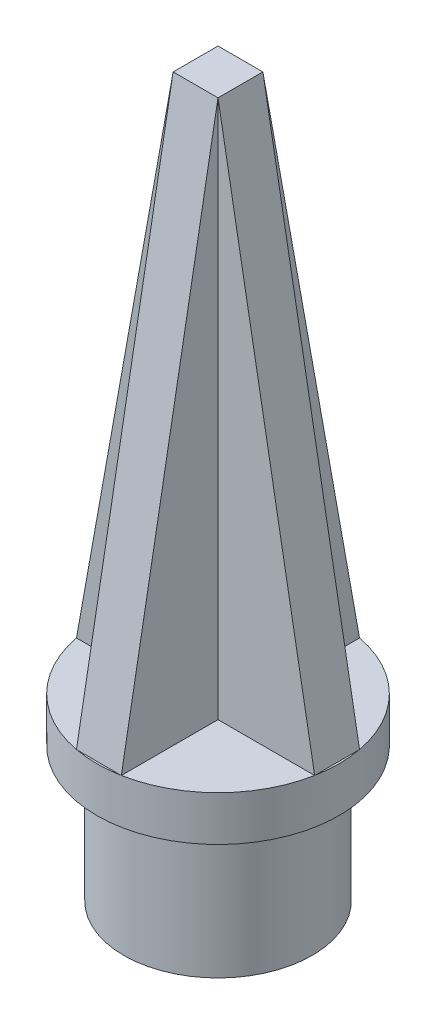
ISO-10303-21;
HEADER;
FILE_DESCRIPTION(('STEP AP214'),'2;1');
FILE_NAME('part.step','',(''),(''),'','','');
FILE_SCHEMA(('AUTOMOTIVE_DESIGN { 1 0 10303 214 1 1 1 1 }'));
ENDSEC;
DATA;
#1=APPLICATION_CONTEXT('core data for automotive mechanical design processes');
#2=APPLICATION_PROTOCOL_DEFINITION('international standard','automotive_design',2000,#1);
#3=PRODUCT_CONTEXT('',#1,'mechanical');
#4=PRODUCT('Part','Part','',(#3));
#5=PRODUCT_RELATED_PRODUCT_CATEGORY('part','',(#4));
#6=PRODUCT_DEFINITION_FORMATION('','',#4);
#7=PRODUCT_DEFINITION_CONTEXT('part definition',#1,'design');
#8=PRODUCT_DEFINITION('design','',#6,#7);
#9=PRODUCT_DEFINITION_SHAPE('','',#8);
#10=(LENGTH_UNIT() NAMED_UNIT(*) SI_UNIT(.MILLI.,.METRE.));
#11=(NAMED_UNIT(*) PLANE_ANGLE_UNIT() SI_UNIT($,.RADIAN.));
#12=(NAMED_UNIT(*) SI_UNIT($,.STERADIAN.) SOLID_ANGLE_UNIT());
#13=UNCERTAINTY_MEASURE_WITH_UNIT(LENGTH_MEASURE(1.E-05),#10,'distance_accuracy_value','');
#14=(GEOMETRIC_REPRESENTATION_CONTEXT(3) GLOBAL_UNCERTAINTY_ASSIGNED_CONTEXT((#13)) GLOBAL_UNIT_ASSIGNED_CONTEXT((#10,
#11,#12)) REPRESENTATION_CONTEXT('',''));
#15=CARTESIAN_POINT('',(0.,0.,0.));
#16=DIRECTION('',(0.,0.,1.));
#17=DIRECTION('',(1.,0.,0.));
#18=AXIS2_PLACEMENT_3D('',#15,#16,#17);
#19=CARTESIAN_POINT('',(0.,20.,0.));
#20=DIRECTION('',(0.,1.,0.));
#21=DIRECTION('',(0.,0.,1.));
#22=AXIS2_PLACEMENT_3D('',#19,#20,#21);
#23=PLANE('',#22);
#24=DIRECTION('',(0.,0.,1.));
#25=VECTOR('',#24,1.);
#26=CARTESIAN_POINT('',(-2.5,20.,-13.2664991614216));
#27=LINE('',#26,#25);
#28=CARTESIAN_POINT('',(-2.5,20.,-13.2664991614216));
#29=VERTEX_POINT('',#28);
#30=CARTESIAN_POINT('',(-2.5,20.,-2.5));
#31=VERTEX_POINT('',#30);
#32=EDGE_CURVE('E142',#29,#31,#27,.T.);
#33=ORIENTED_EDGE('',*,*,#32,.F.);
#34=CARTESIAN_POINT('',(0.,20.,0.));
#35=DIRECTION('',(0.,1.,0.));
#36=DIRECTION('',(0.,0.,1.));
#37=AXIS2_PLACEMENT_3D('',#34,#35,#36);
#38=CIRCLE('',#37,13.5);
#39=CARTESIAN_POINT('',(-13.2664991614216,20.,-2.5));
#40=VERTEX_POINT('',#39);
#41=EDGE_CURVE('E172',#29,#40,#38,.T.);
#42=ORIENTED_EDGE('',*,*,#41,.T.);
#43=DIRECTION('',(-1.,0.,0.));
#44=VECTOR('',#43,1.);
#45=CARTESIAN_POINT('',(-13.2664991614216,20.,-2.5));
#46=LINE('',#45,#44);
#47=EDGE_CURVE('E121',#31,#40,#46,.T.);
#48=ORIENTED_EDGE('',*,*,#47,.F.);
#49=EDGE_LOOP('',(#33,#42,#48));
#50=FACE_BOUND('',#49,.T.);
#51=ADVANCED_FACE('F33',(#50),#23,.T.);
#52=DIRECTION('',(-1.,0.,0.));
#53=VECTOR('',#52,1.);
#54=CARTESIAN_POINT('',(-2.5,20.,-13.2664991614216));
#55=LINE('',#54,#53);
#56=CARTESIAN_POINT('',(2.5,20.,-13.2664991614216));
#57=VERTEX_POINT('',#56);
#58=EDGE_CURVE('E132',#57,#29,#55,.T.);
#59=ORIENTED_EDGE('',*,*,#58,.F.);
#60=EDGE_CURVE('E176',#57,#29,#38,.T.);
#61=ORIENTED_EDGE('',*,*,#60,.T.);
#62=EDGE_LOOP('',(#59,#61));
#63=FACE_BOUND('',#62,.T.);
#64=ADVANCED_FACE('F262',(#63),#23,.T.);
#65=DIRECTION('',(0.,0.,-1.));
#66=VECTOR('',#65,1.);
#67=CARTESIAN_POINT('',(2.5,20.,-13.2664991614216));
#68=LINE('',#67,#66);
#69=CARTESIAN_POINT('',(2.5,20.,-2.5));
#70=VERTEX_POINT('',#69);
#71=EDGE_CURVE('E48',#70,#57,#68,.T.);
#72=ORIENTED_EDGE('',*,*,#71,.F.);
#73=DIRECTION('',(-1.,0.,0.));
#74=VECTOR('',#73,1.);
#75=CARTESIAN_POINT('',(2.5,20.,-2.5));
#76=LINE('',#75,#74);
#77=CARTESIAN_POINT('',(13.2664991614216,20.,-2.5));
#78=VERTEX_POINT('',#77);
#79=EDGE_CURVE('E184',#78,#70,#76,.T.);
#80=ORIENTED_EDGE('',*,*,#79,.F.);
#81=EDGE_CURVE('E159',#78,#57,#38,.T.);
#82=ORIENTED_EDGE('',*,*,#81,.T.);
#83=EDGE_LOOP('',(#72,#80,#82));
#84=FACE_BOUND('',#83,.T.);
#85=ADVANCED_FACE('F183',(#84),#23,.T.);
#86=DIRECTION('',(0.,0.,-1.));
#87=VECTOR('',#86,1.);
#88=CARTESIAN_POINT('',(13.2664991614216,20.,-2.5));
#89=LINE('',#88,#87);
#90=CARTESIAN_POINT('',(13.2664991614216,20.,2.5));
#91=VERTEX_POINT('',#90);
#92=EDGE_CURVE('E194',#91,#78,#89,.T.);
#93=ORIENTED_EDGE('',*,*,#92,.F.);
#94=EDGE_CURVE('E155',#91,#78,#38,.T.);
#95=ORIENTED_EDGE('',*,*,#94,.T.);
#96=EDGE_LOOP('',(#93,#95));
#97=FACE_BOUND('',#96,.T.);
#98=ADVANCED_FACE('F291',(#97),#23,.T.);
#99=DIRECTION('',(1.,0.,0.));
#100=VECTOR('',#99,1.);
#101=CARTESIAN_POINT('',(2.5,20.,2.5));
#102=LINE('',#101,#100);
#103=CARTESIAN_POINT('',(2.5,20.,2.5));
#104=VERTEX_POINT('',#103);
#105=EDGE_CURVE('E56',#104,#91,#102,.T.);
#106=ORIENTED_EDGE('',*,*,#105,.F.);
#107=DIRECTION('',(0.,0.,-1.));
#108=VECTOR('',#107,1.);
#109=CARTESIAN_POINT('',(2.5,20.,2.5));
#110=LINE('',#109,#108);
#111=CARTESIAN_POINT('',(2.5,20.,13.2664991614216));
#112=VERTEX_POINT('',#111);
#113=EDGE_CURVE('E209',#112,#104,#110,.T.);
#114=ORIENTED_EDGE('',*,*,#113,.F.);
#115=EDGE_CURVE('E154',#112,#91,#38,.T.);
#116=ORIENTED_EDGE('',*,*,#115,.T.);
#117=EDGE_LOOP('',(#106,#114,#116));
#118=FACE_BOUND('',#117,.T.);
#119=ADVANCED_FACE('F287',(#118),#23,.T.);
#120=DIRECTION('',(1.,0.,0.));
#121=VECTOR('',#120,1.);
#122=CARTESIAN_POINT('',(-2.5,20.,13.2664991614216));
#123=LINE('',#122,#121);
#124=CARTESIAN_POINT('',(-2.5,20.,13.2664991614216));
#125=VERTEX_POINT('',#124);
#126=EDGE_CURVE('E210',#125,#112,#123,.T.);
#127=ORIENTED_EDGE('',*,*,#126,.F.);
#128=EDGE_CURVE('E147',#125,#112,#38,.T.);
#129=ORIENTED_EDGE('',*,*,#128,.T.);
#130=EDGE_LOOP('',(#127,#129));
#131=FACE_BOUND('',#130,.T.);
#132=ADVANCED_FACE('F281',(#131),#23,.T.);
#133=DIRECTION('',(0.,0.,1.));
#134=VECTOR('',#133,1.);
#135=CARTESIAN_POINT('',(-2.5,20.,2.5));
#136=LINE('',#135,#134);
#137=CARTESIAN_POINT('',(-2.5,20.,2.5));
#138=VERTEX_POINT('',#137);
#139=EDGE_CURVE('E213',#138,#125,#136,.T.);
#140=ORIENTED_EDGE('',*,*,#139,.F.);
#141=DIRECTION('',(1.,0.,0.));
#142=VECTOR('',#141,1.);
#143=CARTESIAN_POINT('',(-13.2664991614216,20.,2.5));
#144=LINE('',#143,#142);
#145=CARTESIAN_POINT('',(-13.2664991614216,20.,2.5));
#146=VERTEX_POINT('',#145);
#147=EDGE_CURVE('E244',#146,#138,#144,.T.);
#148=ORIENTED_EDGE('',*,*,#147,.F.);
#149=EDGE_CURVE('E161',#146,#125,#38,.T.);
#150=ORIENTED_EDGE('',*,*,#149,.T.);
#151=EDGE_LOOP('',(#140,#148,#150));
#152=FACE_BOUND('',#151,.T.);
#153=ADVANCED_FACE('F250',(#152),#23,.T.);
#154=CARTESIAN_POINT('',(0.,15.,0.));
#155=DIRECTION('',(0.,-1.,0.));
#156=DIRECTION('',(0.,0.,-1.));
#157=AXIS2_PLACEMENT_3D('',#154,#155,#156);
#158=CYLINDRICAL_SURFACE('',#157,10.5);
#159=CARTESIAN_POINT('',(0.,15.,0.));
#160=DIRECTION('',(0.,1.,0.));
#161=DIRECTION('',(0.,0.,1.));
#162=AXIS2_PLACEMENT_3D('',#159,#160,#161);
#163=CIRCLE('',#162,10.5);
#164=CARTESIAN_POINT('',(0.,15.,10.5));
#165=VERTEX_POINT('',#164);
#166=EDGE_CURVE('E11',#165,#165,#163,.T.);
#167=ORIENTED_EDGE('',*,*,#166,.F.);
#168=EDGE_LOOP('',(#167));
#169=FACE_BOUND('',#168,.T.);
#170=CARTESIAN_POINT('',(0.,0.,0.));
#171=DIRECTION('',(0.,1.,0.));
#172=DIRECTION('',(0.,0.,1.));
#173=AXIS2_PLACEMENT_3D('',#170,#171,#172);
#174=CIRCLE('',#173,10.5);
#175=CARTESIAN_POINT('',(0.,0.,10.5));
#176=VERTEX_POINT('',#175);
#177=EDGE_CURVE('E37',#176,#176,#174,.T.);
#178=ORIENTED_EDGE('',*,*,#177,.T.);
#179=EDGE_LOOP('',(#178));
#180=FACE_BOUND('',#179,.T.);
#181=ADVANCED_FACE('F35',(#169,#180),#158,.T.);
#182=CARTESIAN_POINT('',(0.,0.,0.));
#183=DIRECTION('',(0.,1.,0.));
#184=DIRECTION('',(0.,0.,1.));
#185=AXIS2_PLACEMENT_3D('',#182,#183,#184);
#186=PLANE('',#185);
#187=CARTESIAN_POINT('',(0.,0.,0.));
#188=DIRECTION('',(0.,-1.,0.));
#189=DIRECTION('',(0.,0.,-1.));
#190=AXIS2_PLACEMENT_3D('',#187,#188,#189);
#191=CIRCLE('',#190,7.5);
#192=CARTESIAN_POINT('',(0.,0.,-7.5));
#193=VERTEX_POINT('',#192);
#194=EDGE_CURVE('E139',#193,#193,#191,.T.);
#195=ORIENTED_EDGE('',*,*,#194,.F.);
#196=EDGE_LOOP('',(#195));
#197=FACE_BOUND('',#196,.T.);
#198=ORIENTED_EDGE('',*,*,#177,.F.);
#199=EDGE_LOOP('',(#198));
#200=FACE_BOUND('',#199,.T.);
#201=ADVANCED_FACE('F278',(#197,#200),#186,.F.);
#202=CARTESIAN_POINT('',(0.,20.,0.));
#203=DIRECTION('',(0.,-1.,0.));
#204=DIRECTION('',(0.,0.,-1.));
#205=AXIS2_PLACEMENT_3D('',#202,#203,#204);
#206=CYLINDRICAL_SURFACE('',#205,13.5);
#207=ORIENTED_EDGE('',*,*,#115,.F.);
#208=ORIENTED_EDGE('',*,*,#128,.F.);
#209=ORIENTED_EDGE('',*,*,#149,.F.);
#210=EDGE_CURVE('E166',#40,#146,#38,.T.);
#211=ORIENTED_EDGE('',*,*,#210,.F.);
#212=ORIENTED_EDGE('',*,*,#41,.F.);
#213=ORIENTED_EDGE('',*,*,#60,.F.);
#214=ORIENTED_EDGE('',*,*,#81,.F.);
#215=ORIENTED_EDGE('',*,*,#94,.F.);
#216=EDGE_LOOP('',(#207,#208,#209,#211,#212,#213,#214,#215));
#217=FACE_BOUND('',#216,.T.);
#218=CARTESIAN_POINT('',(0.,15.,0.));
#219=DIRECTION('',(0.,1.,0.));
#220=DIRECTION('',(0.,0.,1.));
#221=AXIS2_PLACEMENT_3D('',#218,#219,#220);
#222=CIRCLE('',#221,13.5);
#223=CARTESIAN_POINT('',(0.,15.,13.5));
#224=VERTEX_POINT('',#223);
#225=EDGE_CURVE('E143',#224,#224,#222,.T.);
#226=ORIENTED_EDGE('',*,*,#225,.T.);
#227=EDGE_LOOP('',(#226));
#228=FACE_BOUND('',#227,.T.);
#229=ADVANCED_FACE('F272',(#217,#228),#206,.T.);
#230=DIRECTION('',(0.,0.,1.));
#231=VECTOR('',#230,1.);
#232=CARTESIAN_POINT('',(-13.2664991614216,20.,-2.5));
#233=LINE('',#232,#231);
#234=EDGE_CURVE('E242',#40,#146,#233,.T.);
#235=ORIENTED_EDGE('',*,*,#234,.F.);
#236=ORIENTED_EDGE('',*,*,#210,.T.);
#237=EDGE_LOOP('',(#235,#236));
#238=FACE_BOUND('',#237,.T.);
#239=ADVANCED_FACE('F264',(#238),#23,.T.);
#240=CARTESIAN_POINT('',(0.,15.,0.));
#241=DIRECTION('',(0.,1.,0.));
#242=DIRECTION('',(0.,0.,1.));
#243=AXIS2_PLACEMENT_3D('',#240,#241,#242);
#244=PLANE('',#243);
#245=ORIENTED_EDGE('',*,*,#166,.T.);
#246=EDGE_LOOP('',(#245));
#247=FACE_BOUND('',#246,.T.);
#248=ORIENTED_EDGE('',*,*,#225,.F.);
#249=EDGE_LOOP('',(#248));
#250=FACE_BOUND('',#249,.T.);
#251=ADVANCED_FACE('F271',(#247,#250),#244,.F.);
#252=CARTESIAN_POINT('',(-2.5,80.,-13.2664991614216));
#253=DIRECTION('',(1.,0.,0.));
#254=DIRECTION('',(0.,0.,-1.));
#255=AXIS2_PLACEMENT_3D('',#252,#253,#254);
#256=PLANE('',#255);
#257=DIRECTION('',(0.,-1.,0.));
#258=VECTOR('',#257,1.);
#259=CARTESIAN_POINT('',(-2.5,80.,-2.5));
#260=LINE('',#259,#258);
#261=CARTESIAN_POINT('',(-2.5,80.,-2.5));
#262=VERTEX_POINT('',#261);
#263=EDGE_CURVE('E119',#262,#31,#260,.T.);
#264=ORIENTED_EDGE('',*,*,#263,.F.);
#265=DIRECTION('',(0.,0.9842789980251,0.176620650114036));
#266=VECTOR('',#265,1.);
#267=CARTESIAN_POINT('',(-2.5,20.,-13.2664991614216));
#268=LINE('',#267,#266);
#269=EDGE_CURVE('E127',#29,#262,#268,.T.);
#270=ORIENTED_EDGE('',*,*,#269,.F.);
#271=ORIENTED_EDGE('',*,*,#32,.T.);
#272=EDGE_LOOP('',(#264,#270,#271));
#273=FACE_BOUND('',#272,.T.);
#274=ADVANCED_FACE('F141',(#273),#256,.F.);
#275=CARTESIAN_POINT('',(-13.2664991614216,80.,-2.5));
#276=DIRECTION('',(0.,0.,1.));
#277=DIRECTION('',(1.,0.,0.));
#278=AXIS2_PLACEMENT_3D('',#275,#276,#277);
#279=PLANE('',#278);
#280=ORIENTED_EDGE('',*,*,#47,.T.);
#281=DIRECTION('',(-0.176620650114036,-0.9842789980251,0.));
#282=VECTOR('',#281,1.);
#283=CARTESIAN_POINT('',(-2.5,80.,-2.5));
#284=LINE('',#283,#282);
#285=EDGE_CURVE('E104',#262,#40,#284,.T.);
#286=ORIENTED_EDGE('',*,*,#285,.F.);
#287=ORIENTED_EDGE('',*,*,#263,.T.);
#288=EDGE_LOOP('',(#280,#286,#287));
#289=FACE_BOUND('',#288,.T.);
#290=ADVANCED_FACE('F117',(#289),#279,.F.);
#291=CARTESIAN_POINT('',(-13.2664991614216,80.,2.5));
#292=DIRECTION('',(0.,0.,-1.));
#293=DIRECTION('',(-1.,0.,0.));
#294=AXIS2_PLACEMENT_3D('',#291,#292,#293);
#295=PLANE('',#294);
#296=DIRECTION('',(0.,-1.,0.));
#297=VECTOR('',#296,1.);
#298=CARTESIAN_POINT('',(-2.5,80.,2.5));
#299=LINE('',#298,#297);
#300=CARTESIAN_POINT('',(-2.5,80.,2.5));
#301=VERTEX_POINT('',#300);
#302=EDGE_CURVE('E144',#301,#138,#299,.T.);
#303=ORIENTED_EDGE('',*,*,#302,.F.);
#304=DIRECTION('',(0.176620650114036,0.9842789980251,0.));
#305=VECTOR('',#304,1.);
#306=CARTESIAN_POINT('',(-2.5,80.,2.5));
#307=LINE('',#306,#305);
#308=EDGE_CURVE('E107',#146,#301,#307,.T.);
#309=ORIENTED_EDGE('',*,*,#308,.F.);
#310=ORIENTED_EDGE('',*,*,#147,.T.);
#311=EDGE_LOOP('',(#303,#309,#310));
#312=FACE_BOUND('',#311,.T.);
#313=ADVANCED_FACE('F252',(#312),#295,.F.);
#314=CARTESIAN_POINT('',(-2.5,80.,2.5));
#315=DIRECTION('',(1.,0.,0.));
#316=DIRECTION('',(0.,0.,-1.));
#317=AXIS2_PLACEMENT_3D('',#314,#315,#316);
#318=PLANE('',#317);
#319=ORIENTED_EDGE('',*,*,#139,.T.);
#320=DIRECTION('',(0.,-0.9842789980251,0.176620650114036));
#321=VECTOR('',#320,1.);
#322=CARTESIAN_POINT('',(-2.5,80.,2.5));
#323=LINE('',#322,#321);
#324=EDGE_CURVE('E230',#301,#125,#323,.T.);
#325=ORIENTED_EDGE('',*,*,#324,.F.);
#326=ORIENTED_EDGE('',*,*,#302,.T.);
#327=EDGE_LOOP('',(#319,#325,#326));
#328=FACE_BOUND('',#327,.T.);
#329=ADVANCED_FACE('F248',(#328),#318,.F.);
#330=CARTESIAN_POINT('',(2.5,80.,2.5));
#331=DIRECTION('',(-1.,0.,0.));
#332=DIRECTION('',(0.,0.,1.));
#333=AXIS2_PLACEMENT_3D('',#330,#331,#332);
#334=PLANE('',#333);
#335=DIRECTION('',(0.,-1.,0.));
#336=VECTOR('',#335,1.);
#337=CARTESIAN_POINT('',(2.5,80.,2.5));
#338=LINE('',#337,#336);
#339=CARTESIAN_POINT('',(2.5,80.,2.5));
#340=VERTEX_POINT('',#339);
#341=EDGE_CURVE('E150',#340,#104,#338,.T.);
#342=ORIENTED_EDGE('',*,*,#341,.F.);
#343=DIRECTION('',(0.,0.9842789980251,-0.176620650114036));
#344=VECTOR('',#343,1.);
#345=CARTESIAN_POINT('',(2.5,80.,2.5));
#346=LINE('',#345,#344);
#347=EDGE_CURVE('E208',#112,#340,#346,.T.);
#348=ORIENTED_EDGE('',*,*,#347,.F.);
#349=ORIENTED_EDGE('',*,*,#113,.T.);
#350=EDGE_LOOP('',(#342,#348,#349));
#351=FACE_BOUND('',#350,.T.);
#352=ADVANCED_FACE('F207',(#351),#334,.F.);
#353=CARTESIAN_POINT('',(2.5,80.,2.5));
#354=DIRECTION('',(0.,0.,-1.));
#355=DIRECTION('',(-1.,0.,0.));
#356=AXIS2_PLACEMENT_3D('',#353,#354,#355);
#357=PLANE('',#356);
#358=ORIENTED_EDGE('',*,*,#105,.T.);
#359=DIRECTION('',(0.176620650114036,-0.9842789980251,0.));
#360=VECTOR('',#359,1.);
#361=CARTESIAN_POINT('',(2.5,80.,2.5));
#362=LINE('',#361,#360);
#363=EDGE_CURVE('E203',#340,#91,#362,.T.);
#364=ORIENTED_EDGE('',*,*,#363,.F.);
#365=ORIENTED_EDGE('',*,*,#341,.T.);
#366=EDGE_LOOP('',(#358,#364,#365));
#367=FACE_BOUND('',#366,.T.);
#368=ADVANCED_FACE('F202',(#367),#357,.F.);
#369=CARTESIAN_POINT('',(2.5,80.,-2.5));
#370=DIRECTION('',(0.,0.,1.));
#371=DIRECTION('',(1.,0.,0.));
#372=AXIS2_PLACEMENT_3D('',#369,#370,#371);
#373=PLANE('',#372);
#374=DIRECTION('',(0.,-1.,0.));
#375=VECTOR('',#374,1.);
#376=CARTESIAN_POINT('',(2.5,80.,-2.5));
#377=LINE('',#376,#375);
#378=CARTESIAN_POINT('',(2.5,80.,-2.5));
#379=VERTEX_POINT('',#378);
#380=EDGE_CURVE('E191',#379,#70,#377,.T.);
#381=ORIENTED_EDGE('',*,*,#380,.F.);
#382=DIRECTION('',(-0.176620650114036,0.9842789980251,0.));
#383=VECTOR('',#382,1.);
#384=CARTESIAN_POINT('',(2.5,80.,-2.5));
#385=LINE('',#384,#383);
#386=EDGE_CURVE('E220',#78,#379,#385,.T.);
#387=ORIENTED_EDGE('',*,*,#386,.F.);
#388=ORIENTED_EDGE('',*,*,#79,.T.);
#389=EDGE_LOOP('',(#381,#387,#388));
#390=FACE_BOUND('',#389,.T.);
#391=ADVANCED_FACE('F223',(#390),#373,.F.);
#392=CARTESIAN_POINT('',(2.5,80.,-13.2664991614216));
#393=DIRECTION('',(-1.,0.,0.));
#394=DIRECTION('',(0.,0.,1.));
#395=AXIS2_PLACEMENT_3D('',#392,#393,#394);
#396=PLANE('',#395);
#397=ORIENTED_EDGE('',*,*,#71,.T.);
#398=DIRECTION('',(0.,-0.9842789980251,-0.176620650114036));
#399=VECTOR('',#398,1.);
#400=CARTESIAN_POINT('',(2.5,20.,-13.2664991614216));
#401=LINE('',#400,#399);
#402=EDGE_CURVE('E135',#379,#57,#401,.T.);
#403=ORIENTED_EDGE('',*,*,#402,.F.);
#404=ORIENTED_EDGE('',*,*,#380,.T.);
#405=EDGE_LOOP('',(#397,#403,#404));
#406=FACE_BOUND('',#405,.T.);
#407=ADVANCED_FACE('F189',(#406),#396,.F.);
#408=CARTESIAN_POINT('',(0.,80.,0.));
#409=DIRECTION('',(0.,1.,0.));
#410=DIRECTION('',(0.,0.,1.));
#411=AXIS2_PLACEMENT_3D('',#408,#409,#410);
#412=PLANE('',#411);
#413=DIRECTION('',(0.,0.,-1.));
#414=VECTOR('',#413,1.);
#415=CARTESIAN_POINT('',(-2.5,80.,13.501));
#416=LINE('',#415,#414);
#417=EDGE_CURVE('E101',#301,#262,#416,.T.);
#418=ORIENTED_EDGE('',*,*,#417,.F.);
#419=DIRECTION('',(-1.,0.,0.));
#420=VECTOR('',#419,1.);
#421=CARTESIAN_POINT('',(13.501,80.,2.5));
#422=LINE('',#421,#420);
#423=EDGE_CURVE('E232',#340,#301,#422,.T.);
#424=ORIENTED_EDGE('',*,*,#423,.F.);
#425=DIRECTION('',(0.,0.,-1.));
#426=VECTOR('',#425,1.);
#427=CARTESIAN_POINT('',(2.5,80.,13.501));
#428=LINE('',#427,#426);
#429=EDGE_CURVE('E122',#340,#379,#428,.T.);
#430=ORIENTED_EDGE('',*,*,#429,.T.);
#431=DIRECTION('',(-1.,0.,0.));
#432=VECTOR('',#431,1.);
#433=CARTESIAN_POINT('',(13.501,80.,-2.5));
#434=LINE('',#433,#432);
#435=EDGE_CURVE('E129',#379,#262,#434,.T.);
#436=ORIENTED_EDGE('',*,*,#435,.T.);
#437=EDGE_LOOP('',(#418,#424,#430,#436));
#438=FACE_BOUND('',#437,.T.);
#439=ADVANCED_FACE('F138',(#438),#412,.T.);
#440=CARTESIAN_POINT('',(0.,15.,0.));
#441=DIRECTION('',(0.,1.,0.));
#442=DIRECTION('',(0.,0.,1.));
#443=AXIS2_PLACEMENT_3D('',#440,#441,#442);
#444=PLANE('',#443);
#445=CARTESIAN_POINT('',(0.,15.,0.));
#446=DIRECTION('',(0.,1.,0.));
#447=DIRECTION('',(0.,0.,1.));
#448=AXIS2_PLACEMENT_3D('',#445,#446,#447);
#449=CIRCLE('',#448,7.5);
#450=CARTESIAN_POINT('',(0.,15.,7.5));
#451=VERTEX_POINT('',#450);
#452=EDGE_CURVE('E237',#451,#451,#449,.F.);
#453=ORIENTED_EDGE('',*,*,#452,.T.);
#454=EDGE_LOOP('',(#453));
#455=FACE_BOUND('',#454,.T.);
#456=ADVANCED_FACE('F378',(#455),#444,.F.);
#457=CARTESIAN_POINT('',(0.,36.2132034355964,0.));
#458=DIRECTION('',(0.,-1.,0.));
#459=DIRECTION('',(0.,0.,-1.));
#460=AXIS2_PLACEMENT_3D('',#457,#458,#459);
#461=CYLINDRICAL_SURFACE('',#460,7.5);
#462=ORIENTED_EDGE('',*,*,#194,.T.);
#463=EDGE_LOOP('',(#462));
#464=FACE_BOUND('',#463,.T.);
#465=ORIENTED_EDGE('',*,*,#452,.F.);
#466=EDGE_LOOP('',(#465));
#467=FACE_BOUND('',#466,.T.);
#468=ADVANCED_FACE('F310',(#464,#467),#461,.F.);
#469=CARTESIAN_POINT('',(13.501,80.,2.5));
#470=DIRECTION('',(0.,-0.176620650114036,-0.9842789980251));
#471=DIRECTION('',(0.,0.9842789980251,-0.176620650114036));
#472=AXIS2_PLACEMENT_3D('',#469,#470,#471);
#473=PLANE('',#472);
#474=ORIENTED_EDGE('',*,*,#347,.T.);
#475=ORIENTED_EDGE('',*,*,#423,.T.);
#476=ORIENTED_EDGE('',*,*,#324,.T.);
#477=ORIENTED_EDGE('',*,*,#126,.T.);
#478=EDGE_LOOP('',(#474,#475,#476,#477));
#479=FACE_BOUND('',#478,.T.);
#480=ADVANCED_FACE('F392',(#479),#473,.F.);
#481=CARTESIAN_POINT('',(13.501,20.,-13.2664991614216));
#482=DIRECTION('',(0.,-0.176620650114036,0.9842789980251));
#483=DIRECTION('',(0.,-0.9842789980251,-0.176620650114036));
#484=AXIS2_PLACEMENT_3D('',#481,#482,#483);
#485=PLANE('',#484);
#486=ORIENTED_EDGE('',*,*,#402,.T.);
#487=ORIENTED_EDGE('',*,*,#58,.T.);
#488=ORIENTED_EDGE('',*,*,#269,.T.);
#489=ORIENTED_EDGE('',*,*,#435,.F.);
#490=EDGE_LOOP('',(#486,#487,#488,#489));
#491=FACE_BOUND('',#490,.T.);
#492=ADVANCED_FACE('F128',(#491),#485,.F.);
#493=CARTESIAN_POINT('',(2.5,80.,13.501));
#494=DIRECTION('',(-0.9842789980251,-0.176620650114036,0.));
#495=DIRECTION('',(0.176620650114036,-0.9842789980251,0.));
#496=AXIS2_PLACEMENT_3D('',#493,#494,#495);
#497=PLANE('',#496);
#498=ORIENTED_EDGE('',*,*,#363,.T.);
#499=ORIENTED_EDGE('',*,*,#92,.T.);
#500=ORIENTED_EDGE('',*,*,#386,.T.);
#501=ORIENTED_EDGE('',*,*,#429,.F.);
#502=EDGE_LOOP('',(#498,#499,#500,#501));
#503=FACE_BOUND('',#502,.T.);
#504=ADVANCED_FACE('F219',(#503),#497,.F.);
#505=CARTESIAN_POINT('',(-2.5,80.,13.501));
#506=DIRECTION('',(0.9842789980251,-0.176620650114036,0.));
#507=DIRECTION('',(0.176620650114036,0.9842789980251,0.));
#508=AXIS2_PLACEMENT_3D('',#505,#506,#507);
#509=PLANE('',#508);
#510=ORIENTED_EDGE('',*,*,#308,.T.);
#511=ORIENTED_EDGE('',*,*,#417,.T.);
#512=ORIENTED_EDGE('',*,*,#285,.T.);
#513=ORIENTED_EDGE('',*,*,#234,.T.);
#514=EDGE_LOOP('',(#510,#511,#512,#513));
#515=FACE_BOUND('',#514,.T.);
#516=ADVANCED_FACE('F103',(#515),#509,.F.);
#517=CLOSED_SHELL('',(#51,#64,#85,#98,#119,#132,#153,#181,#201,#229,#239,#251,#274,#290,#313,
#329,#352,#368,#391,#407,#439,#456,#468,#480,#492,#504,#516));
#518=MANIFOLD_SOLID_BREP('B2',#517);
#519=ADVANCED_BREP_SHAPE_REPRESENTATION('',(#18,#518),#14);
#520=SHAPE_DEFINITION_REPRESENTATION(#9,#519);
ENDSEC;
END-ISO-10303-21;
